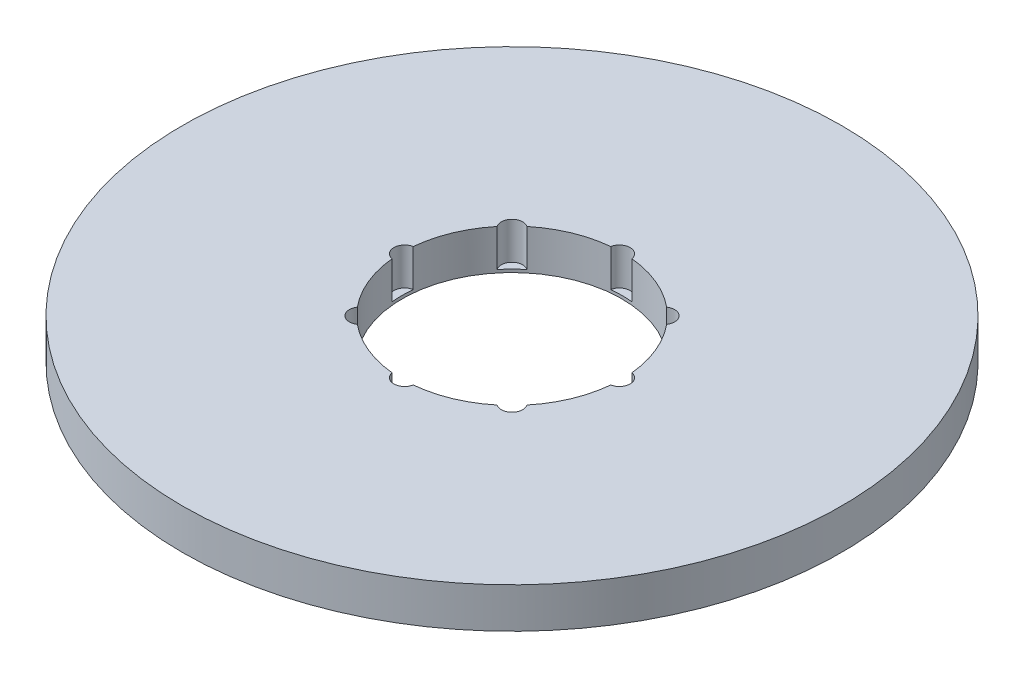
ISO-10303-21;
HEADER;
FILE_DESCRIPTION(('STEP AP214'),'2;1');
FILE_NAME('part.step','',(''),(''),'','','');
FILE_SCHEMA(('AUTOMOTIVE_DESIGN { 1 0 10303 214 1 1 1 1 }'));
ENDSEC;
DATA;
#1=APPLICATION_CONTEXT('core data for automotive mechanical design processes');
#2=APPLICATION_PROTOCOL_DEFINITION('international standard','automotive_design',2000,#1);
#3=PRODUCT_CONTEXT('',#1,'mechanical');
#4=PRODUCT('Part','Part','',(#3));
#5=PRODUCT_RELATED_PRODUCT_CATEGORY('part','',(#4));
#6=PRODUCT_DEFINITION_FORMATION('','',#4);
#7=PRODUCT_DEFINITION_CONTEXT('part definition',#1,'design');
#8=PRODUCT_DEFINITION('design','',#6,#7);
#9=PRODUCT_DEFINITION_SHAPE('','',#8);
#10=(LENGTH_UNIT() NAMED_UNIT(*) SI_UNIT(.MILLI.,.METRE.));
#11=(NAMED_UNIT(*) PLANE_ANGLE_UNIT() SI_UNIT($,.RADIAN.));
#12=(NAMED_UNIT(*) SI_UNIT($,.STERADIAN.) SOLID_ANGLE_UNIT());
#13=UNCERTAINTY_MEASURE_WITH_UNIT(LENGTH_MEASURE(1.E-05),#10,'distance_accuracy_value','');
#14=(GEOMETRIC_REPRESENTATION_CONTEXT(3) GLOBAL_UNCERTAINTY_ASSIGNED_CONTEXT((#13)) GLOBAL_UNIT_ASSIGNED_CONTEXT((#10,
#11,#12)) REPRESENTATION_CONTEXT('',''));
#15=CARTESIAN_POINT('',(0.,0.,0.));
#16=DIRECTION('',(0.,0.,1.));
#17=DIRECTION('',(1.,0.,0.));
#18=AXIS2_PLACEMENT_3D('',#15,#16,#17);
#19=CARTESIAN_POINT('',(0.,11.,0.));
#20=DIRECTION('',(0.,-1.,0.));
#21=DIRECTION('',(0.,0.,-1.));
#22=AXIS2_PLACEMENT_3D('',#19,#20,#21);
#23=CYLINDRICAL_SURFACE('',#22,90.);
#24=CARTESIAN_POINT('',(0.,11.,0.));
#25=DIRECTION('',(0.,1.,0.));
#26=DIRECTION('',(0.,0.,1.));
#27=AXIS2_PLACEMENT_3D('',#24,#25,#26);
#28=CIRCLE('',#27,90.);
#29=CARTESIAN_POINT('',(0.,11.,90.));
#30=VERTEX_POINT('',#29);
#31=EDGE_CURVE('E183',#30,#30,#28,.T.);
#32=ORIENTED_EDGE('',*,*,#31,.F.);
#33=EDGE_LOOP('',(#32));
#34=FACE_BOUND('',#33,.T.);
#35=CARTESIAN_POINT('',(0.,0.,0.));
#36=DIRECTION('',(0.,1.,0.));
#37=DIRECTION('',(0.,0.,1.));
#38=AXIS2_PLACEMENT_3D('',#35,#36,#37);
#39=CIRCLE('',#38,90.);
#40=CARTESIAN_POINT('',(0.,0.,90.));
#41=VERTEX_POINT('',#40);
#42=EDGE_CURVE('E182',#41,#41,#39,.T.);
#43=ORIENTED_EDGE('',*,*,#42,.T.);
#44=EDGE_LOOP('',(#43));
#45=FACE_BOUND('',#44,.T.);
#46=ADVANCED_FACE('F39',(#34,#45),#23,.T.);
#47=CARTESIAN_POINT('',(0.,11.,0.));
#48=DIRECTION('',(0.,1.,0.));
#49=DIRECTION('',(0.,0.,1.));
#50=AXIS2_PLACEMENT_3D('',#47,#48,#49);
#51=PLANE('',#50);
#52=CARTESIAN_POINT('',(1.02429272007874E-13,11.,29.3369094854773));
#53=DIRECTION('',(0.,1.,0.));
#54=DIRECTION('',(1.,0.,0.));
#55=AXIS2_PLACEMENT_3D('',#52,#53,#54);
#56=CIRCLE('',#55,2.92693474405659);
#57=CARTESIAN_POINT('',(-2.87954310436003,11.,29.8614840808379));
#58=VERTEX_POINT('',#57);
#59=CARTESIAN_POINT('',(2.87954310436024,11.,29.8614840808378));
#60=VERTEX_POINT('',#59);
#61=EDGE_CURVE('E256',#58,#60,#56,.T.);
#62=ORIENTED_EDGE('',*,*,#61,.F.);
#63=CARTESIAN_POINT('',(0.,11.,0.));
#64=DIRECTION('',(0.,1.,0.));
#65=DIRECTION('',(0.,0.,1.));
#66=AXIS2_PLACEMENT_3D('',#63,#64,#65);
#67=CIRCLE('',#66,30.);
#68=CARTESIAN_POINT('',(-19.0791134340425,11.,23.1514023456666));
#69=VERTEX_POINT('',#68);
#70=EDGE_CURVE('E175',#69,#58,#67,.T.);
#71=ORIENTED_EDGE('',*,*,#70,.F.);
#72=CARTESIAN_POINT('',(-20.7443276362369,11.,20.744327636237));
#73=DIRECTION('',(0.,1.,0.));
#74=DIRECTION('',(0.707106781186549,0.,0.707106781186546));
#75=AXIS2_PLACEMENT_3D('',#72,#73,#74);
#76=CIRCLE('',#75,2.92693474405659);
#77=CARTESIAN_POINT('',(-23.1514023456666,11.,19.0791134340426));
#78=VERTEX_POINT('',#77);
#79=EDGE_CURVE('E152',#78,#69,#76,.T.);
#80=ORIENTED_EDGE('',*,*,#79,.F.);
#81=CARTESIAN_POINT('',(-29.8614840808378,11.,2.87954310436013));
#82=VERTEX_POINT('',#81);
#83=EDGE_CURVE('E168',#82,#78,#67,.T.);
#84=ORIENTED_EDGE('',*,*,#83,.F.);
#85=CARTESIAN_POINT('',(-29.3369094854773,11.,0.));
#86=DIRECTION('',(0.,1.,0.));
#87=DIRECTION('',(0.,0.,1.));
#88=AXIS2_PLACEMENT_3D('',#85,#86,#87);
#89=CIRCLE('',#88,2.92693474405659);
#90=CARTESIAN_POINT('',(-29.8614840808378,11.,-2.87954310436013));
#91=VERTEX_POINT('',#90);
#92=EDGE_CURVE('E205',#91,#82,#89,.T.);
#93=ORIENTED_EDGE('',*,*,#92,.F.);
#94=CARTESIAN_POINT('',(-23.1514023456668,11.,-19.0791134340423));
#95=VERTEX_POINT('',#94);
#96=EDGE_CURVE('E181',#95,#91,#67,.T.);
#97=ORIENTED_EDGE('',*,*,#96,.F.);
#98=CARTESIAN_POINT('',(-20.7443276362372,11.,-20.7443276362367));
#99=DIRECTION('',(0.,1.,0.));
#100=DIRECTION('',(-0.707106781186539,0.,0.707106781186556));
#101=AXIS2_PLACEMENT_3D('',#98,#99,#100);
#102=CIRCLE('',#101,2.92693474405659);
#103=CARTESIAN_POINT('',(-19.0791134340428,11.,-23.1514023456664));
#104=VERTEX_POINT('',#103);
#105=EDGE_CURVE('E453',#104,#95,#102,.T.);
#106=ORIENTED_EDGE('',*,*,#105,.F.);
#107=CARTESIAN_POINT('',(-2.87954310436044,11.,-29.8614840808378));
#108=VERTEX_POINT('',#107);
#109=EDGE_CURVE('E189',#108,#104,#67,.T.);
#110=ORIENTED_EDGE('',*,*,#109,.F.);
#111=CARTESIAN_POINT('',(-3.07287816023622E-13,11.,-29.3369094854773));
#112=DIRECTION('',(0.,1.,0.));
#113=DIRECTION('',(-1.,0.,0.));
#114=AXIS2_PLACEMENT_3D('',#111,#112,#113);
#115=CIRCLE('',#114,2.92693474405659);
#116=CARTESIAN_POINT('',(2.87954310435982,11.,-29.8614840808379));
#117=VERTEX_POINT('',#116);
#118=EDGE_CURVE('E462',#117,#108,#115,.T.);
#119=ORIENTED_EDGE('',*,*,#118,.F.);
#120=CARTESIAN_POINT('',(19.0791134340424,11.,-23.1514023456668));
#121=VERTEX_POINT('',#120);
#122=EDGE_CURVE('E197',#121,#117,#67,.T.);
#123=ORIENTED_EDGE('',*,*,#122,.F.);
#124=CARTESIAN_POINT('',(20.7443276362368,11.,-20.7443276362371));
#125=DIRECTION('',(0.,1.,0.));
#126=DIRECTION('',(-0.707106781186554,0.,-0.707106781186541));
#127=AXIS2_PLACEMENT_3D('',#124,#125,#126);
#128=CIRCLE('',#127,2.92693474405659);
#129=CARTESIAN_POINT('',(23.1514023456664,11.,-19.0791134340428));
#130=VERTEX_POINT('',#129);
#131=EDGE_CURVE('E470',#130,#121,#128,.T.);
#132=ORIENTED_EDGE('',*,*,#131,.F.);
#133=CARTESIAN_POINT('',(29.8614840808378,11.,-2.87954310436013));
#134=VERTEX_POINT('',#133);
#135=EDGE_CURVE('E489',#134,#130,#67,.T.);
#136=ORIENTED_EDGE('',*,*,#135,.F.);
#137=CARTESIAN_POINT('',(29.3369094854773,11.,0.));
#138=DIRECTION('',(0.,1.,0.));
#139=DIRECTION('',(0.,0.,-1.));
#140=AXIS2_PLACEMENT_3D('',#137,#138,#139);
#141=CIRCLE('',#140,2.92693474405659);
#142=CARTESIAN_POINT('',(29.8614840808378,11.,2.87954310436013));
#143=VERTEX_POINT('',#142);
#144=EDGE_CURVE('E476',#143,#134,#141,.T.);
#145=ORIENTED_EDGE('',*,*,#144,.F.);
#146=CARTESIAN_POINT('',(23.1514023456667,11.,19.0791134340424));
#147=VERTEX_POINT('',#146);
#148=EDGE_CURVE('E491',#147,#143,#67,.T.);
#149=ORIENTED_EDGE('',*,*,#148,.F.);
#150=CARTESIAN_POINT('',(20.7443276362371,11.,20.7443276362369));
#151=DIRECTION('',(0.,1.,0.));
#152=DIRECTION('',(0.707106781186544,0.,-0.707106781186551));
#153=AXIS2_PLACEMENT_3D('',#150,#151,#152);
#154=CIRCLE('',#153,2.92693474405659);
#155=CARTESIAN_POINT('',(19.0791134340427,11.,23.1514023456665));
#156=VERTEX_POINT('',#155);
#157=EDGE_CURVE('E475',#156,#147,#154,.T.);
#158=ORIENTED_EDGE('',*,*,#157,.F.);
#159=EDGE_CURVE('E190',#60,#156,#67,.T.);
#160=ORIENTED_EDGE('',*,*,#159,.F.);
#161=EDGE_LOOP('',(#62,#71,#80,#84,#93,#97,#106,#110,#119,#123,#132,#136,#145,#149,#158,#160));
#162=FACE_BOUND('',#161,.T.);
#163=ORIENTED_EDGE('',*,*,#31,.T.);
#164=EDGE_LOOP('',(#163));
#165=FACE_BOUND('',#164,.T.);
#166=ADVANCED_FACE('F170',(#162,#165),#51,.T.);
#167=CARTESIAN_POINT('',(0.,0.,0.));
#168=DIRECTION('',(0.,1.,0.));
#169=DIRECTION('',(0.,0.,1.));
#170=AXIS2_PLACEMENT_3D('',#167,#168,#169);
#171=PLANE('',#170);
#172=CARTESIAN_POINT('',(0.,0.,0.));
#173=DIRECTION('',(0.,1.,0.));
#174=DIRECTION('',(0.,0.,1.));
#175=AXIS2_PLACEMENT_3D('',#172,#173,#174);
#176=CIRCLE('',#175,30.);
#177=CARTESIAN_POINT('',(0.,0.,30.));
#178=VERTEX_POINT('',#177);
#179=EDGE_CURVE('E191',#178,#178,#176,.T.);
#180=ORIENTED_EDGE('',*,*,#179,.T.);
#181=EDGE_LOOP('',(#180));
#182=FACE_BOUND('',#181,.T.);
#183=ORIENTED_EDGE('',*,*,#42,.F.);
#184=EDGE_LOOP('',(#183));
#185=FACE_BOUND('',#184,.T.);
#186=ADVANCED_FACE('F277',(#182,#185),#171,.F.);
#187=CARTESIAN_POINT('',(0.,11.,0.));
#188=DIRECTION('',(0.,-1.,0.));
#189=DIRECTION('',(0.,0.,-1.));
#190=AXIS2_PLACEMENT_3D('',#187,#188,#189);
#191=CYLINDRICAL_SURFACE('',#190,30.);
#192=DIRECTION('',(0.,1.,0.));
#193=VECTOR('',#192,1.);
#194=CARTESIAN_POINT('',(-2.87954310436003,5.91344575394955,29.8614840808379));
#195=LINE('',#194,#193);
#196=CARTESIAN_POINT('',(-2.87954310436003,0.826891507899096,29.8614840808379));
#197=VERTEX_POINT('',#196);
#198=EDGE_CURVE('E11',#197,#58,#195,.T.);
#199=ORIENTED_EDGE('',*,*,#198,.F.);
#200=CARTESIAN_POINT('',(0.,0.826891507899096,0.));
#201=DIRECTION('',(0.,1.,0.));
#202=DIRECTION('',(0.,0.,1.));
#203=AXIS2_PLACEMENT_3D('',#200,#201,#202);
#204=CIRCLE('',#203,30.);
#205=CARTESIAN_POINT('',(2.87954310436024,0.826891507899096,29.8614840808378));
#206=VERTEX_POINT('',#205);
#207=EDGE_CURVE('E251',#197,#206,#204,.T.);
#208=ORIENTED_EDGE('',*,*,#207,.T.);
#209=DIRECTION('',(0.,1.,0.));
#210=VECTOR('',#209,1.);
#211=CARTESIAN_POINT('',(2.87954310436024,5.91344575394955,29.8614840808378));
#212=LINE('',#211,#210);
#213=EDGE_CURVE('E46',#60,#206,#212,.F.);
#214=ORIENTED_EDGE('',*,*,#213,.F.);
#215=ORIENTED_EDGE('',*,*,#159,.T.);
#216=DIRECTION('',(0.,1.,0.));
#217=VECTOR('',#216,1.);
#218=CARTESIAN_POINT('',(19.0791134340427,5.91344575394955,23.1514023456665));
#219=LINE('',#218,#217);
#220=CARTESIAN_POINT('',(19.0791134340427,0.826891507899096,23.1514023456665));
#221=VERTEX_POINT('',#220);
#222=EDGE_CURVE('E253',#221,#156,#219,.T.);
#223=ORIENTED_EDGE('',*,*,#222,.F.);
#224=CARTESIAN_POINT('',(0.,0.826891507899096,0.));
#225=DIRECTION('',(0.,1.,0.));
#226=DIRECTION('',(0.,0.,1.));
#227=AXIS2_PLACEMENT_3D('',#224,#225,#226);
#228=CIRCLE('',#227,30.);
#229=CARTESIAN_POINT('',(23.1514023456667,0.826891507899096,19.0791134340424));
#230=VERTEX_POINT('',#229);
#231=EDGE_CURVE('E246',#221,#230,#228,.T.);
#232=ORIENTED_EDGE('',*,*,#231,.T.);
#233=DIRECTION('',(0.,1.,0.));
#234=VECTOR('',#233,1.);
#235=CARTESIAN_POINT('',(23.1514023456667,5.91344575394955,19.0791134340424));
#236=LINE('',#235,#234);
#237=EDGE_CURVE('E248',#147,#230,#236,.F.);
#238=ORIENTED_EDGE('',*,*,#237,.F.);
#239=ORIENTED_EDGE('',*,*,#148,.T.);
#240=DIRECTION('',(0.,1.,0.));
#241=VECTOR('',#240,1.);
#242=CARTESIAN_POINT('',(29.8614840808378,5.91344575394955,2.87954310436013));
#243=LINE('',#242,#241);
#244=CARTESIAN_POINT('',(29.8614840808378,0.826891507899096,2.87954310436013));
#245=VERTEX_POINT('',#244);
#246=EDGE_CURVE('E243',#245,#143,#243,.T.);
#247=ORIENTED_EDGE('',*,*,#246,.F.);
#248=CARTESIAN_POINT('',(0.,0.826891507899096,0.));
#249=DIRECTION('',(0.,1.,0.));
#250=DIRECTION('',(0.,0.,1.));
#251=AXIS2_PLACEMENT_3D('',#248,#249,#250);
#252=CIRCLE('',#251,30.);
#253=CARTESIAN_POINT('',(29.8614840808378,0.826891507899096,-2.87954310436013));
#254=VERTEX_POINT('',#253);
#255=EDGE_CURVE('E236',#245,#254,#252,.T.);
#256=ORIENTED_EDGE('',*,*,#255,.T.);
#257=DIRECTION('',(0.,1.,0.));
#258=VECTOR('',#257,1.);
#259=CARTESIAN_POINT('',(29.8614840808378,5.91344575394955,-2.87954310436013));
#260=LINE('',#259,#258);
#261=EDGE_CURVE('E241',#134,#254,#260,.F.);
#262=ORIENTED_EDGE('',*,*,#261,.F.);
#263=ORIENTED_EDGE('',*,*,#135,.T.);
#264=DIRECTION('',(0.,1.,0.));
#265=VECTOR('',#264,1.);
#266=CARTESIAN_POINT('',(23.1514023456664,5.91344575394955,-19.0791134340428));
#267=LINE('',#266,#265);
#268=CARTESIAN_POINT('',(23.1514023456664,0.826891507899096,-19.0791134340428));
#269=VERTEX_POINT('',#268);
#270=EDGE_CURVE('E237',#269,#130,#267,.T.);
#271=ORIENTED_EDGE('',*,*,#270,.F.);
#272=CARTESIAN_POINT('',(0.,0.826891507899096,0.));
#273=DIRECTION('',(0.,1.,0.));
#274=DIRECTION('',(0.,0.,1.));
#275=AXIS2_PLACEMENT_3D('',#272,#273,#274);
#276=CIRCLE('',#275,30.);
#277=CARTESIAN_POINT('',(19.0791134340424,0.826891507899096,-23.1514023456668));
#278=VERTEX_POINT('',#277);
#279=EDGE_CURVE('E229',#269,#278,#276,.T.);
#280=ORIENTED_EDGE('',*,*,#279,.T.);
#281=DIRECTION('',(0.,1.,0.));
#282=VECTOR('',#281,1.);
#283=CARTESIAN_POINT('',(19.0791134340424,5.91344575394955,-23.1514023456668));
#284=LINE('',#283,#282);
#285=EDGE_CURVE('E232',#121,#278,#284,.F.);
#286=ORIENTED_EDGE('',*,*,#285,.F.);
#287=ORIENTED_EDGE('',*,*,#122,.T.);
#288=DIRECTION('',(0.,1.,0.));
#289=VECTOR('',#288,1.);
#290=CARTESIAN_POINT('',(2.87954310435982,5.91344575394955,-29.8614840808379));
#291=LINE('',#290,#289);
#292=CARTESIAN_POINT('',(2.87954310435982,0.826891507899096,-29.8614840808379));
#293=VERTEX_POINT('',#292);
#294=EDGE_CURVE('E227',#293,#117,#291,.T.);
#295=ORIENTED_EDGE('',*,*,#294,.F.);
#296=CARTESIAN_POINT('',(0.,0.826891507899096,0.));
#297=DIRECTION('',(0.,1.,0.));
#298=DIRECTION('',(0.,0.,1.));
#299=AXIS2_PLACEMENT_3D('',#296,#297,#298);
#300=CIRCLE('',#299,30.);
#301=CARTESIAN_POINT('',(-2.87954310436044,0.826891507899096,-29.8614840808378));
#302=VERTEX_POINT('',#301);
#303=EDGE_CURVE('E225',#293,#302,#300,.T.);
#304=ORIENTED_EDGE('',*,*,#303,.T.);
#305=DIRECTION('',(0.,1.,0.));
#306=VECTOR('',#305,1.);
#307=CARTESIAN_POINT('',(-2.87954310436044,5.91344575394955,-29.8614840808378));
#308=LINE('',#307,#306);
#309=EDGE_CURVE('E223',#108,#302,#308,.F.);
#310=ORIENTED_EDGE('',*,*,#309,.F.);
#311=ORIENTED_EDGE('',*,*,#109,.T.);
#312=DIRECTION('',(0.,1.,0.));
#313=VECTOR('',#312,1.);
#314=CARTESIAN_POINT('',(-19.0791134340428,5.91344575394955,-23.1514023456664));
#315=LINE('',#314,#313);
#316=CARTESIAN_POINT('',(-19.0791134340428,0.826891507899096,-23.1514023456664));
#317=VERTEX_POINT('',#316);
#318=EDGE_CURVE('E219',#317,#104,#315,.T.);
#319=ORIENTED_EDGE('',*,*,#318,.F.);
#320=CARTESIAN_POINT('',(0.,0.826891507899096,0.));
#321=DIRECTION('',(0.,1.,0.));
#322=DIRECTION('',(0.,0.,1.));
#323=AXIS2_PLACEMENT_3D('',#320,#321,#322);
#324=CIRCLE('',#323,30.);
#325=CARTESIAN_POINT('',(-23.1514023456668,0.826891507899096,-19.0791134340423));
#326=VERTEX_POINT('',#325);
#327=EDGE_CURVE('E159',#317,#326,#324,.T.);
#328=ORIENTED_EDGE('',*,*,#327,.T.);
#329=DIRECTION('',(0.,1.,0.));
#330=VECTOR('',#329,1.);
#331=CARTESIAN_POINT('',(-23.1514023456668,5.91344575394955,-19.0791134340423));
#332=LINE('',#331,#330);
#333=EDGE_CURVE('E220',#95,#326,#332,.F.);
#334=ORIENTED_EDGE('',*,*,#333,.F.);
#335=ORIENTED_EDGE('',*,*,#96,.T.);
#336=DIRECTION('',(0.,1.,0.));
#337=VECTOR('',#336,1.);
#338=CARTESIAN_POINT('',(-29.8614840808378,5.91344575394955,-2.87954310436013));
#339=LINE('',#338,#337);
#340=CARTESIAN_POINT('',(-29.8614840808378,0.826891507899096,-2.87954310436013));
#341=VERTEX_POINT('',#340);
#342=EDGE_CURVE('E209',#341,#91,#339,.T.);
#343=ORIENTED_EDGE('',*,*,#342,.F.);
#344=CARTESIAN_POINT('',(0.,0.826891507899096,0.));
#345=DIRECTION('',(0.,1.,0.));
#346=DIRECTION('',(0.,0.,1.));
#347=AXIS2_PLACEMENT_3D('',#344,#345,#346);
#348=CIRCLE('',#347,30.);
#349=CARTESIAN_POINT('',(-29.8614840808378,0.826891507899096,2.87954310436013));
#350=VERTEX_POINT('',#349);
#351=EDGE_CURVE('E206',#341,#350,#348,.T.);
#352=ORIENTED_EDGE('',*,*,#351,.T.);
#353=DIRECTION('',(0.,1.,0.));
#354=VECTOR('',#353,1.);
#355=CARTESIAN_POINT('',(-29.8614840808378,5.91344575394955,2.87954310436013));
#356=LINE('',#355,#354);
#357=EDGE_CURVE('E179',#82,#350,#356,.F.);
#358=ORIENTED_EDGE('',*,*,#357,.F.);
#359=ORIENTED_EDGE('',*,*,#83,.T.);
#360=DIRECTION('',(0.,1.,0.));
#361=VECTOR('',#360,1.);
#362=CARTESIAN_POINT('',(-23.1514023456666,5.91344575394955,19.0791134340426));
#363=LINE('',#362,#361);
#364=CARTESIAN_POINT('',(-23.1514023456666,0.826891507899096,19.0791134340426));
#365=VERTEX_POINT('',#364);
#366=EDGE_CURVE('E147',#365,#78,#363,.T.);
#367=ORIENTED_EDGE('',*,*,#366,.F.);
#368=CARTESIAN_POINT('',(0.,0.826891507899096,0.));
#369=DIRECTION('',(0.,1.,0.));
#370=DIRECTION('',(0.,0.,1.));
#371=AXIS2_PLACEMENT_3D('',#368,#369,#370);
#372=CIRCLE('',#371,30.);
#373=CARTESIAN_POINT('',(-19.0791134340425,0.826891507899096,23.1514023456666));
#374=VERTEX_POINT('',#373);
#375=EDGE_CURVE('E215',#365,#374,#372,.T.);
#376=ORIENTED_EDGE('',*,*,#375,.T.);
#377=DIRECTION('',(0.,1.,0.));
#378=VECTOR('',#377,1.);
#379=CARTESIAN_POINT('',(-19.0791134340425,5.91344575394955,23.1514023456666));
#380=LINE('',#379,#378);
#381=EDGE_CURVE('E161',#69,#374,#380,.F.);
#382=ORIENTED_EDGE('',*,*,#381,.F.);
#383=ORIENTED_EDGE('',*,*,#70,.T.);
#384=EDGE_LOOP('',(#199,#208,#214,#215,#223,#232,#238,#239,#247,#256,#262,#263,#271,#280,#286,
#287,#295,#304,#310,#311,#319,#328,#334,#335,#343,#352,#358,#359,#367,#376,#382,#383));
#385=FACE_BOUND('',#384,.T.);
#386=ORIENTED_EDGE('',*,*,#179,.F.);
#387=EDGE_LOOP('',(#386));
#388=FACE_BOUND('',#387,.T.);
#389=ADVANCED_FACE('F176',(#385,#388),#191,.F.);
#390=CARTESIAN_POINT('',(-29.3369094854773,0.826891507899096,0.));
#391=DIRECTION('',(0.,1.,0.));
#392=DIRECTION('',(0.,0.,1.));
#393=AXIS2_PLACEMENT_3D('',#390,#391,#392);
#394=CYLINDRICAL_SURFACE('',#393,2.92693474405659);
#395=ORIENTED_EDGE('',*,*,#342,.T.);
#396=ORIENTED_EDGE('',*,*,#92,.T.);
#397=ORIENTED_EDGE('',*,*,#357,.T.);
#398=CARTESIAN_POINT('',(-29.3369094854773,0.826891507899096,0.));
#399=DIRECTION('',(0.,1.,0.));
#400=DIRECTION('',(0.,0.,1.));
#401=AXIS2_PLACEMENT_3D('',#398,#399,#400);
#402=CIRCLE('',#401,2.92693474405659);
#403=EDGE_CURVE('E200',#341,#350,#402,.T.);
#404=ORIENTED_EDGE('',*,*,#403,.F.);
#405=EDGE_LOOP('',(#395,#396,#397,#404));
#406=FACE_BOUND('',#405,.T.);
#407=ADVANCED_FACE('F286',(#406),#394,.F.);
#408=CARTESIAN_POINT('',(-29.3369094854773,0.826891507899096,0.));
#409=DIRECTION('',(0.,1.,0.));
#410=DIRECTION('',(0.,0.,1.));
#411=AXIS2_PLACEMENT_3D('',#408,#409,#410);
#412=PLANE('',#411);
#413=ORIENTED_EDGE('',*,*,#403,.T.);
#414=ORIENTED_EDGE('',*,*,#351,.F.);
#415=EDGE_LOOP('',(#413,#414));
#416=FACE_BOUND('',#415,.T.);
#417=ADVANCED_FACE('F289',(#416),#412,.T.);
#418=CARTESIAN_POINT('',(-20.7443276362369,0.826891507899096,20.744327636237));
#419=DIRECTION('',(0.,1.,0.));
#420=DIRECTION('',(0.,0.,1.));
#421=AXIS2_PLACEMENT_3D('',#418,#419,#420);
#422=CYLINDRICAL_SURFACE('',#421,2.92693474405659);
#423=ORIENTED_EDGE('',*,*,#366,.T.);
#424=ORIENTED_EDGE('',*,*,#79,.T.);
#425=ORIENTED_EDGE('',*,*,#381,.T.);
#426=CARTESIAN_POINT('',(-20.7443276362369,0.826891507899096,20.744327636237));
#427=DIRECTION('',(0.,1.,0.));
#428=DIRECTION('',(0.707106781186549,0.,0.707106781186546));
#429=AXIS2_PLACEMENT_3D('',#426,#427,#428);
#430=CIRCLE('',#429,2.92693474405659);
#431=EDGE_CURVE('E156',#365,#374,#430,.T.);
#432=ORIENTED_EDGE('',*,*,#431,.F.);
#433=EDGE_LOOP('',(#423,#424,#425,#432));
#434=FACE_BOUND('',#433,.T.);
#435=ADVANCED_FACE('F155',(#434),#422,.F.);
#436=CARTESIAN_POINT('',(-20.7443276362369,0.826891507899096,20.744327636237));
#437=DIRECTION('',(0.,1.,0.));
#438=DIRECTION('',(0.707106781186549,0.,0.707106781186546));
#439=AXIS2_PLACEMENT_3D('',#436,#437,#438);
#440=PLANE('',#439);
#441=ORIENTED_EDGE('',*,*,#431,.T.);
#442=ORIENTED_EDGE('',*,*,#375,.F.);
#443=EDGE_LOOP('',(#441,#442));
#444=FACE_BOUND('',#443,.T.);
#445=ADVANCED_FACE('F300',(#444),#440,.T.);
#446=CARTESIAN_POINT('',(-20.7443276362372,0.826891507899096,-20.7443276362367));
#447=DIRECTION('',(0.,1.,0.));
#448=DIRECTION('',(0.,0.,1.));
#449=AXIS2_PLACEMENT_3D('',#446,#447,#448);
#450=CYLINDRICAL_SURFACE('',#449,2.92693474405659);
#451=ORIENTED_EDGE('',*,*,#318,.T.);
#452=ORIENTED_EDGE('',*,*,#105,.T.);
#453=ORIENTED_EDGE('',*,*,#333,.T.);
#454=CARTESIAN_POINT('',(-20.7443276362372,0.826891507899096,-20.7443276362367));
#455=DIRECTION('',(0.,1.,0.));
#456=DIRECTION('',(-0.707106781186539,0.,0.707106781186556));
#457=AXIS2_PLACEMENT_3D('',#454,#455,#456);
#458=CIRCLE('',#457,2.92693474405659);
#459=EDGE_CURVE('E454',#317,#326,#458,.T.);
#460=ORIENTED_EDGE('',*,*,#459,.F.);
#461=EDGE_LOOP('',(#451,#452,#453,#460));
#462=FACE_BOUND('',#461,.T.);
#463=ADVANCED_FACE('F299',(#462),#450,.F.);
#464=CARTESIAN_POINT('',(-20.7443276362372,0.826891507899096,-20.7443276362367));
#465=DIRECTION('',(0.,1.,0.));
#466=DIRECTION('',(-0.707106781186539,0.,0.707106781186556));
#467=AXIS2_PLACEMENT_3D('',#464,#465,#466);
#468=PLANE('',#467);
#469=ORIENTED_EDGE('',*,*,#459,.T.);
#470=ORIENTED_EDGE('',*,*,#327,.F.);
#471=EDGE_LOOP('',(#469,#470));
#472=FACE_BOUND('',#471,.T.);
#473=ADVANCED_FACE('F379',(#472),#468,.T.);
#474=CARTESIAN_POINT('',(-3.07287816023622E-13,0.826891507899096,-29.3369094854773));
#475=DIRECTION('',(0.,1.,0.));
#476=DIRECTION('',(0.,0.,1.));
#477=AXIS2_PLACEMENT_3D('',#474,#475,#476);
#478=CYLINDRICAL_SURFACE('',#477,2.92693474405659);
#479=ORIENTED_EDGE('',*,*,#294,.T.);
#480=ORIENTED_EDGE('',*,*,#118,.T.);
#481=ORIENTED_EDGE('',*,*,#309,.T.);
#482=CARTESIAN_POINT('',(-3.07287816023622E-13,0.826891507899096,-29.3369094854773));
#483=DIRECTION('',(0.,1.,0.));
#484=DIRECTION('',(-1.,0.,0.));
#485=AXIS2_PLACEMENT_3D('',#482,#483,#484);
#486=CIRCLE('',#485,2.92693474405659);
#487=EDGE_CURVE('E465',#293,#302,#486,.T.);
#488=ORIENTED_EDGE('',*,*,#487,.F.);
#489=EDGE_LOOP('',(#479,#480,#481,#488));
#490=FACE_BOUND('',#489,.T.);
#491=ADVANCED_FACE('F371',(#490),#478,.F.);
#492=CARTESIAN_POINT('',(-3.07287816023622E-13,0.826891507899096,-29.3369094854773));
#493=DIRECTION('',(0.,1.,0.));
#494=DIRECTION('',(-1.,0.,0.));
#495=AXIS2_PLACEMENT_3D('',#492,#493,#494);
#496=PLANE('',#495);
#497=ORIENTED_EDGE('',*,*,#487,.T.);
#498=ORIENTED_EDGE('',*,*,#303,.F.);
#499=EDGE_LOOP('',(#497,#498));
#500=FACE_BOUND('',#499,.T.);
#501=ADVANCED_FACE('F308',(#500),#496,.T.);
#502=CARTESIAN_POINT('',(20.7443276362368,0.826891507899096,-20.7443276362371));
#503=DIRECTION('',(0.,1.,0.));
#504=DIRECTION('',(0.,0.,1.));
#505=AXIS2_PLACEMENT_3D('',#502,#503,#504);
#506=CYLINDRICAL_SURFACE('',#505,2.92693474405659);
#507=ORIENTED_EDGE('',*,*,#270,.T.);
#508=ORIENTED_EDGE('',*,*,#131,.T.);
#509=ORIENTED_EDGE('',*,*,#285,.T.);
#510=CARTESIAN_POINT('',(20.7443276362368,0.826891507899096,-20.7443276362371));
#511=DIRECTION('',(0.,1.,0.));
#512=DIRECTION('',(-0.707106781186554,0.,-0.707106781186541));
#513=AXIS2_PLACEMENT_3D('',#510,#511,#512);
#514=CIRCLE('',#513,2.92693474405659);
#515=EDGE_CURVE('E477',#269,#278,#514,.T.);
#516=ORIENTED_EDGE('',*,*,#515,.F.);
#517=EDGE_LOOP('',(#507,#508,#509,#516));
#518=FACE_BOUND('',#517,.T.);
#519=ADVANCED_FACE('F305',(#518),#506,.F.);
#520=CARTESIAN_POINT('',(20.7443276362368,0.826891507899096,-20.7443276362371));
#521=DIRECTION('',(0.,1.,0.));
#522=DIRECTION('',(-0.707106781186554,0.,-0.707106781186541));
#523=AXIS2_PLACEMENT_3D('',#520,#521,#522);
#524=PLANE('',#523);
#525=ORIENTED_EDGE('',*,*,#515,.T.);
#526=ORIENTED_EDGE('',*,*,#279,.F.);
#527=EDGE_LOOP('',(#525,#526));
#528=FACE_BOUND('',#527,.T.);
#529=ADVANCED_FACE('F304',(#528),#524,.T.);
#530=CARTESIAN_POINT('',(29.3369094854773,0.826891507899096,0.));
#531=DIRECTION('',(0.,1.,0.));
#532=DIRECTION('',(0.,0.,1.));
#533=AXIS2_PLACEMENT_3D('',#530,#531,#532);
#534=CYLINDRICAL_SURFACE('',#533,2.92693474405659);
#535=ORIENTED_EDGE('',*,*,#246,.T.);
#536=ORIENTED_EDGE('',*,*,#144,.T.);
#537=ORIENTED_EDGE('',*,*,#261,.T.);
#538=CARTESIAN_POINT('',(29.3369094854773,0.826891507899096,0.));
#539=DIRECTION('',(0.,1.,0.));
#540=DIRECTION('',(0.,0.,-1.));
#541=AXIS2_PLACEMENT_3D('',#538,#539,#540);
#542=CIRCLE('',#541,2.92693474405659);
#543=EDGE_CURVE('E478',#245,#254,#542,.T.);
#544=ORIENTED_EDGE('',*,*,#543,.F.);
#545=EDGE_LOOP('',(#535,#536,#537,#544));
#546=FACE_BOUND('',#545,.T.);
#547=ADVANCED_FACE('F309',(#546),#534,.F.);
#548=CARTESIAN_POINT('',(29.3369094854773,0.826891507899096,0.));
#549=DIRECTION('',(0.,1.,0.));
#550=DIRECTION('',(0.,0.,-1.));
#551=AXIS2_PLACEMENT_3D('',#548,#549,#550);
#552=PLANE('',#551);
#553=ORIENTED_EDGE('',*,*,#543,.T.);
#554=ORIENTED_EDGE('',*,*,#255,.F.);
#555=EDGE_LOOP('',(#553,#554));
#556=FACE_BOUND('',#555,.T.);
#557=ADVANCED_FACE('F314',(#556),#552,.T.);
#558=CARTESIAN_POINT('',(20.7443276362371,0.826891507899096,20.7443276362369));
#559=DIRECTION('',(0.,1.,0.));
#560=DIRECTION('',(0.,0.,1.));
#561=AXIS2_PLACEMENT_3D('',#558,#559,#560);
#562=CYLINDRICAL_SURFACE('',#561,2.92693474405659);
#563=ORIENTED_EDGE('',*,*,#222,.T.);
#564=ORIENTED_EDGE('',*,*,#157,.T.);
#565=ORIENTED_EDGE('',*,*,#237,.T.);
#566=CARTESIAN_POINT('',(20.7443276362371,0.826891507899096,20.7443276362369));
#567=DIRECTION('',(0.,1.,0.));
#568=DIRECTION('',(0.707106781186544,0.,-0.707106781186551));
#569=AXIS2_PLACEMENT_3D('',#566,#567,#568);
#570=CIRCLE('',#569,2.92693474405659);
#571=EDGE_CURVE('E56',#221,#230,#570,.T.);
#572=ORIENTED_EDGE('',*,*,#571,.F.);
#573=EDGE_LOOP('',(#563,#564,#565,#572));
#574=FACE_BOUND('',#573,.T.);
#575=ADVANCED_FACE('F318',(#574),#562,.F.);
#576=CARTESIAN_POINT('',(20.7443276362371,0.826891507899096,20.7443276362369));
#577=DIRECTION('',(0.,1.,0.));
#578=DIRECTION('',(0.707106781186544,0.,-0.707106781186551));
#579=AXIS2_PLACEMENT_3D('',#576,#577,#578);
#580=PLANE('',#579);
#581=ORIENTED_EDGE('',*,*,#571,.T.);
#582=ORIENTED_EDGE('',*,*,#231,.F.);
#583=EDGE_LOOP('',(#581,#582));
#584=FACE_BOUND('',#583,.T.);
#585=ADVANCED_FACE('F270',(#584),#580,.T.);
#586=CARTESIAN_POINT('',(1.02429272007874E-13,0.826891507899096,29.3369094854773));
#587=DIRECTION('',(0.,1.,0.));
#588=DIRECTION('',(0.,0.,1.));
#589=AXIS2_PLACEMENT_3D('',#586,#587,#588);
#590=CYLINDRICAL_SURFACE('',#589,2.92693474405659);
#591=ORIENTED_EDGE('',*,*,#198,.T.);
#592=ORIENTED_EDGE('',*,*,#61,.T.);
#593=ORIENTED_EDGE('',*,*,#213,.T.);
#594=CARTESIAN_POINT('',(1.02429272007874E-13,0.826891507899096,29.3369094854773));
#595=DIRECTION('',(0.,1.,0.));
#596=DIRECTION('',(1.,0.,0.));
#597=AXIS2_PLACEMENT_3D('',#594,#595,#596);
#598=CIRCLE('',#597,2.92693474405659);
#599=EDGE_CURVE('E55',#197,#206,#598,.T.);
#600=ORIENTED_EDGE('',*,*,#599,.F.);
#601=EDGE_LOOP('',(#591,#592,#593,#600));
#602=FACE_BOUND('',#601,.T.);
#603=ADVANCED_FACE('F260',(#602),#590,.F.);
#604=CARTESIAN_POINT('',(1.02429272007874E-13,0.826891507899096,29.3369094854773));
#605=DIRECTION('',(0.,1.,0.));
#606=DIRECTION('',(1.,0.,0.));
#607=AXIS2_PLACEMENT_3D('',#604,#605,#606);
#608=PLANE('',#607);
#609=ORIENTED_EDGE('',*,*,#599,.T.);
#610=ORIENTED_EDGE('',*,*,#207,.F.);
#611=EDGE_LOOP('',(#609,#610));
#612=FACE_BOUND('',#611,.T.);
#613=ADVANCED_FACE('F261',(#612),#608,.T.);
#614=CLOSED_SHELL('',(#46,#166,#186,#389,#407,#417,#435,#445,#463,#473,#491,#501,#519,#529,#547,
#557,#575,#585,#603,#613));
#615=MANIFOLD_SOLID_BREP('B2',#614);
#616=ADVANCED_BREP_SHAPE_REPRESENTATION('',(#18,#615),#14);
#617=SHAPE_DEFINITION_REPRESENTATION(#9,#616);
ENDSEC;
END-ISO-10303-21;
